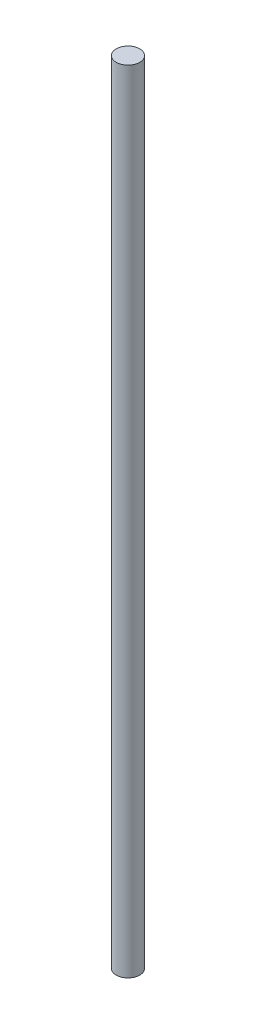
ISO-10303-21;
HEADER;
FILE_DESCRIPTION(('STEP AP214'),'2;1');
FILE_NAME('part.step','',(''),(''),'','','');
FILE_SCHEMA(('AUTOMOTIVE_DESIGN { 1 0 10303 214 1 1 1 1 }'));
ENDSEC;
DATA;
#1=APPLICATION_CONTEXT('core data for automotive mechanical design processes');
#2=APPLICATION_PROTOCOL_DEFINITION('international standard','automotive_design',2000,#1);
#3=PRODUCT_CONTEXT('',#1,'mechanical');
#4=PRODUCT('Part','Part','',(#3));
#5=PRODUCT_RELATED_PRODUCT_CATEGORY('part','',(#4));
#6=PRODUCT_DEFINITION_FORMATION('','',#4);
#7=PRODUCT_DEFINITION_CONTEXT('part definition',#1,'design');
#8=PRODUCT_DEFINITION('design','',#6,#7);
#9=PRODUCT_DEFINITION_SHAPE('','',#8);
#10=(LENGTH_UNIT() NAMED_UNIT(*) SI_UNIT(.MILLI.,.METRE.));
#11=(NAMED_UNIT(*) PLANE_ANGLE_UNIT() SI_UNIT($,.RADIAN.));
#12=(NAMED_UNIT(*) SI_UNIT($,.STERADIAN.) SOLID_ANGLE_UNIT());
#13=UNCERTAINTY_MEASURE_WITH_UNIT(LENGTH_MEASURE(1.E-05),#10,'distance_accuracy_value','');
#14=(GEOMETRIC_REPRESENTATION_CONTEXT(3) GLOBAL_UNCERTAINTY_ASSIGNED_CONTEXT((#13)) GLOBAL_UNIT_ASSIGNED_CONTEXT((#10,
#11,#12)) REPRESENTATION_CONTEXT('',''));
#15=CARTESIAN_POINT('',(0.,0.,0.));
#16=DIRECTION('',(0.,0.,1.));
#17=DIRECTION('',(1.,0.,0.));
#18=AXIS2_PLACEMENT_3D('',#15,#16,#17);
#19=CARTESIAN_POINT('',(0.,270.,0.));
#20=DIRECTION('',(0.,-1.,0.));
#21=DIRECTION('',(0.,0.,-1.));
#22=AXIS2_PLACEMENT_3D('',#19,#20,#21);
#23=CYLINDRICAL_SURFACE('',#22,4.);
#24=CARTESIAN_POINT('',(0.,270.,0.));
#25=DIRECTION('',(0.,1.,0.));
#26=DIRECTION('',(0.,0.,1.));
#27=AXIS2_PLACEMENT_3D('',#24,#25,#26);
#28=CIRCLE('',#27,4.);
#29=CARTESIAN_POINT('',(0.,270.,4.));
#30=VERTEX_POINT('',#29);
#31=EDGE_CURVE('E12',#30,#30,#28,.T.);
#32=ORIENTED_EDGE('',*,*,#31,.F.);
#33=EDGE_LOOP('',(#32));
#34=FACE_BOUND('',#33,.T.);
#35=CARTESIAN_POINT('',(0.,0.,0.));
#36=DIRECTION('',(0.,1.,0.));
#37=DIRECTION('',(0.,0.,1.));
#38=AXIS2_PLACEMENT_3D('',#35,#36,#37);
#39=CIRCLE('',#38,4.);
#40=CARTESIAN_POINT('',(0.,0.,4.));
#41=VERTEX_POINT('',#40);
#42=EDGE_CURVE('E47',#41,#41,#39,.T.);
#43=ORIENTED_EDGE('',*,*,#42,.T.);
#44=EDGE_LOOP('',(#43));
#45=FACE_BOUND('',#44,.T.);
#46=ADVANCED_FACE('F44',(#34,#45),#23,.T.);
#47=CARTESIAN_POINT('',(0.,270.,0.));
#48=DIRECTION('',(0.,1.,0.));
#49=DIRECTION('',(0.,0.,1.));
#50=AXIS2_PLACEMENT_3D('',#47,#48,#49);
#51=PLANE('',#50);
#52=ORIENTED_EDGE('',*,*,#31,.T.);
#53=EDGE_LOOP('',(#52));
#54=FACE_BOUND('',#53,.T.);
#55=ADVANCED_FACE('F61',(#54),#51,.T.);
#56=CARTESIAN_POINT('',(0.,0.,0.));
#57=DIRECTION('',(0.,1.,0.));
#58=DIRECTION('',(0.,0.,1.));
#59=AXIS2_PLACEMENT_3D('',#56,#57,#58);
#60=PLANE('',#59);
#61=ORIENTED_EDGE('',*,*,#42,.F.);
#62=EDGE_LOOP('',(#61));
#63=FACE_BOUND('',#62,.T.);
#64=ADVANCED_FACE('F59',(#63),#60,.F.);
#65=CLOSED_SHELL('',(#46,#55,#64));
#66=MANIFOLD_SOLID_BREP('B2',#65);
#67=ADVANCED_BREP_SHAPE_REPRESENTATION('',(#18,#66),#14);
#68=SHAPE_DEFINITION_REPRESENTATION(#9,#67);
ENDSEC;
END-ISO-10303-21;
